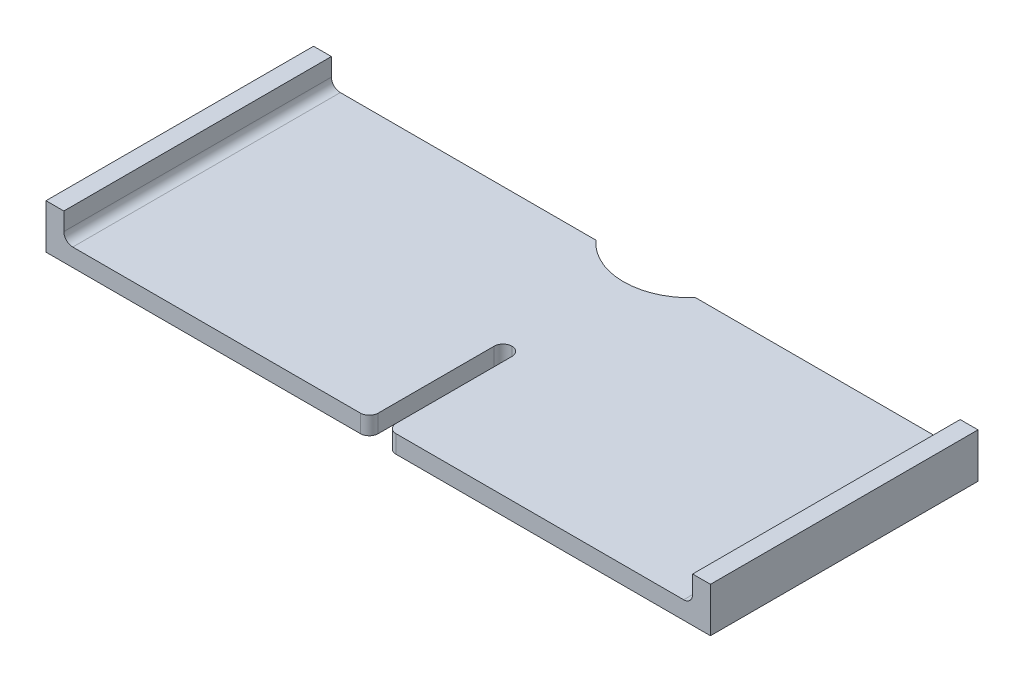
ISO-10303-21;
HEADER;
FILE_DESCRIPTION(('STEP AP214'),'2;1');
FILE_NAME('part.step','',(''),(''),'','','');
FILE_SCHEMA(('AUTOMOTIVE_DESIGN { 1 0 10303 214 1 1 1 1 }'));
ENDSEC;
DATA;
#1=APPLICATION_CONTEXT('core data for automotive mechanical design processes');
#2=APPLICATION_PROTOCOL_DEFINITION('international standard','automotive_design',2000,#1);
#3=PRODUCT_CONTEXT('',#1,'mechanical');
#4=PRODUCT('Part','Part','',(#3));
#5=PRODUCT_RELATED_PRODUCT_CATEGORY('part','',(#4));
#6=PRODUCT_DEFINITION_FORMATION('','',#4);
#7=PRODUCT_DEFINITION_CONTEXT('part definition',#1,'design');
#8=PRODUCT_DEFINITION('design','',#6,#7);
#9=PRODUCT_DEFINITION_SHAPE('','',#8);
#10=(LENGTH_UNIT() NAMED_UNIT(*) SI_UNIT(.MILLI.,.METRE.));
#11=(NAMED_UNIT(*) PLANE_ANGLE_UNIT() SI_UNIT($,.RADIAN.));
#12=(NAMED_UNIT(*) SI_UNIT($,.STERADIAN.) SOLID_ANGLE_UNIT());
#13=UNCERTAINTY_MEASURE_WITH_UNIT(LENGTH_MEASURE(1.E-05),#10,'distance_accuracy_value','');
#14=(GEOMETRIC_REPRESENTATION_CONTEXT(3) GLOBAL_UNCERTAINTY_ASSIGNED_CONTEXT((#13)) GLOBAL_UNIT_ASSIGNED_CONTEXT((#10,
#11,#12)) REPRESENTATION_CONTEXT('',''));
#15=CARTESIAN_POINT('',(0.,0.,0.));
#16=DIRECTION('',(0.,0.,1.));
#17=DIRECTION('',(1.,0.,0.));
#18=AXIS2_PLACEMENT_3D('',#15,#16,#17);
#19=CARTESIAN_POINT('',(37.25,2.,-15.));
#20=DIRECTION('',(0.,0.,1.));
#21=DIRECTION('',(1.,0.,0.));
#22=AXIS2_PLACEMENT_3D('',#19,#20,#21);
#23=PLANE('',#22);
#24=DIRECTION('',(-1.,0.,0.));
#25=VECTOR('',#24,1.);
#26=CARTESIAN_POINT('',(37.25,0.,-15.));
#27=LINE('',#26,#25);
#28=CARTESIAN_POINT('',(37.25,0.,-15.));
#29=VERTEX_POINT('',#28);
#30=CARTESIAN_POINT('',(5.59016994374948,0.,-15.));
#31=VERTEX_POINT('',#30);
#32=EDGE_CURVE('E196',#29,#31,#27,.T.);
#33=ORIENTED_EDGE('',*,*,#32,.T.);
#34=DIRECTION('',(0.,1.,0.));
#35=VECTOR('',#34,1.);
#36=CARTESIAN_POINT('',(5.59016994374948,0.,-15.));
#37=LINE('',#36,#35);
#38=CARTESIAN_POINT('',(5.59016994374948,2.,-15.));
#39=VERTEX_POINT('',#38);
#40=EDGE_CURVE('E175',#31,#39,#37,.T.);
#41=ORIENTED_EDGE('',*,*,#40,.T.);
#42=DIRECTION('',(-1.,0.,0.));
#43=VECTOR('',#42,1.);
#44=CARTESIAN_POINT('',(37.25,2.,-15.));
#45=LINE('',#44,#43);
#46=CARTESIAN_POINT('',(34.25,2.,-15.));
#47=VERTEX_POINT('',#46);
#48=EDGE_CURVE('E207',#47,#39,#45,.T.);
#49=ORIENTED_EDGE('',*,*,#48,.F.);
#50=CARTESIAN_POINT('',(34.25,3.,-15.));
#51=DIRECTION('',(0.,0.,1.));
#52=DIRECTION('',(1.,0.,0.));
#53=AXIS2_PLACEMENT_3D('',#50,#51,#52);
#54=CIRCLE('',#53,1.);
#55=CARTESIAN_POINT('',(35.25,3.,-15.));
#56=VERTEX_POINT('',#55);
#57=EDGE_CURVE('E46',#47,#56,#54,.T.);
#58=ORIENTED_EDGE('',*,*,#57,.T.);
#59=DIRECTION('',(0.,-1.,0.));
#60=VECTOR('',#59,1.);
#61=CARTESIAN_POINT('',(35.25,5.,-15.));
#62=LINE('',#61,#60);
#63=CARTESIAN_POINT('',(35.25,5.,-15.));
#64=VERTEX_POINT('',#63);
#65=EDGE_CURVE('E262',#64,#56,#62,.T.);
#66=ORIENTED_EDGE('',*,*,#65,.F.);
#67=DIRECTION('',(-1.,0.,0.));
#68=VECTOR('',#67,1.);
#69=CARTESIAN_POINT('',(37.25,5.,-15.));
#70=LINE('',#69,#68);
#71=CARTESIAN_POINT('',(37.25,5.,-15.));
#72=VERTEX_POINT('',#71);
#73=EDGE_CURVE('E301',#72,#64,#70,.T.);
#74=ORIENTED_EDGE('',*,*,#73,.F.);
#75=DIRECTION('',(0.,-1.,0.));
#76=VECTOR('',#75,1.);
#77=CARTESIAN_POINT('',(37.25,2.,-15.));
#78=LINE('',#77,#76);
#79=EDGE_CURVE('E206',#72,#29,#78,.T.);
#80=ORIENTED_EDGE('',*,*,#79,.T.);
#81=EDGE_LOOP('',(#33,#41,#49,#58,#66,#74,#80));
#82=FACE_BOUND('',#81,.T.);
#83=ADVANCED_FACE('F37',(#82),#23,.F.);
#84=CARTESIAN_POINT('',(37.25,2.,15.));
#85=DIRECTION('',(0.,0.,-1.));
#86=DIRECTION('',(-1.,0.,0.));
#87=AXIS2_PLACEMENT_3D('',#84,#85,#86);
#88=PLANE('',#87);
#89=DIRECTION('',(1.,0.,0.));
#90=VECTOR('',#89,1.);
#91=CARTESIAN_POINT('',(37.25,0.,15.));
#92=LINE('',#91,#90);
#93=CARTESIAN_POINT('',(-37.25,0.,15.));
#94=VERTEX_POINT('',#93);
#95=CARTESIAN_POINT('',(-2.,0.,15.));
#96=VERTEX_POINT('',#95);
#97=EDGE_CURVE('E200',#94,#96,#92,.T.);
#98=ORIENTED_EDGE('',*,*,#97,.T.);
#99=DIRECTION('',(0.,1.,0.));
#100=VECTOR('',#99,1.);
#101=CARTESIAN_POINT('',(-2.,2.,15.));
#102=LINE('',#101,#100);
#103=CARTESIAN_POINT('',(-2.,2.,15.));
#104=VERTEX_POINT('',#103);
#105=EDGE_CURVE('E235',#96,#104,#102,.T.);
#106=ORIENTED_EDGE('',*,*,#105,.T.);
#107=DIRECTION('',(1.,0.,0.));
#108=VECTOR('',#107,1.);
#109=CARTESIAN_POINT('',(37.25,2.,15.));
#110=LINE('',#109,#108);
#111=CARTESIAN_POINT('',(-34.25,2.,15.));
#112=VERTEX_POINT('',#111);
#113=EDGE_CURVE('E283',#112,#104,#110,.T.);
#114=ORIENTED_EDGE('',*,*,#113,.F.);
#115=CARTESIAN_POINT('',(-34.25,3.,15.));
#116=DIRECTION('',(0.,0.,-1.));
#117=DIRECTION('',(-1.,0.,0.));
#118=AXIS2_PLACEMENT_3D('',#115,#116,#117);
#119=CIRCLE('',#118,1.);
#120=CARTESIAN_POINT('',(-35.25,3.,15.));
#121=VERTEX_POINT('',#120);
#122=EDGE_CURVE('E253',#112,#121,#119,.T.);
#123=ORIENTED_EDGE('',*,*,#122,.T.);
#124=DIRECTION('',(0.,-1.,0.));
#125=VECTOR('',#124,1.);
#126=CARTESIAN_POINT('',(-35.25,5.,15.));
#127=LINE('',#126,#125);
#128=CARTESIAN_POINT('',(-35.25,5.,15.));
#129=VERTEX_POINT('',#128);
#130=EDGE_CURVE('E306',#129,#121,#127,.T.);
#131=ORIENTED_EDGE('',*,*,#130,.F.);
#132=DIRECTION('',(1.,0.,0.));
#133=VECTOR('',#132,1.);
#134=CARTESIAN_POINT('',(-37.25,5.,15.));
#135=LINE('',#134,#133);
#136=CARTESIAN_POINT('',(-37.25,5.,15.));
#137=VERTEX_POINT('',#136);
#138=EDGE_CURVE('E321',#137,#129,#135,.T.);
#139=ORIENTED_EDGE('',*,*,#138,.F.);
#140=DIRECTION('',(0.,-1.,0.));
#141=VECTOR('',#140,1.);
#142=CARTESIAN_POINT('',(-37.25,2.,15.));
#143=LINE('',#142,#141);
#144=EDGE_CURVE('E180',#137,#94,#143,.T.);
#145=ORIENTED_EDGE('',*,*,#144,.T.);
#146=EDGE_LOOP('',(#98,#106,#114,#123,#131,#139,#145));
#147=FACE_BOUND('',#146,.T.);
#148=ADVANCED_FACE('F345',(#147),#88,.F.);
#149=CARTESIAN_POINT('',(0.,2.,0.));
#150=DIRECTION('',(0.,1.,0.));
#151=DIRECTION('',(0.,0.,1.));
#152=AXIS2_PLACEMENT_3D('',#149,#150,#151);
#153=PLANE('',#152);
#154=DIRECTION('',(0.,0.,-1.));
#155=VECTOR('',#154,1.);
#156=CARTESIAN_POINT('',(1.,2.,0.));
#157=LINE('',#156,#155);
#158=CARTESIAN_POINT('',(1.,2.,14.));
#159=VERTEX_POINT('',#158);
#160=CARTESIAN_POINT('',(1.,2.,1.));
#161=VERTEX_POINT('',#160);
#162=EDGE_CURVE('E329',#159,#161,#157,.T.);
#163=ORIENTED_EDGE('',*,*,#162,.F.);
#164=CARTESIAN_POINT('',(2.,2.,14.));
#165=DIRECTION('',(0.,1.,0.));
#166=DIRECTION('',(0.,0.,1.));
#167=AXIS2_PLACEMENT_3D('',#164,#165,#166);
#168=CIRCLE('',#167,1.);
#169=CARTESIAN_POINT('',(2.,2.,15.));
#170=VERTEX_POINT('',#169);
#171=EDGE_CURVE('E227',#159,#170,#168,.T.);
#172=ORIENTED_EDGE('',*,*,#171,.T.);
#173=CARTESIAN_POINT('',(34.25,2.,15.));
#174=VERTEX_POINT('',#173);
#175=EDGE_CURVE('E199',#170,#174,#110,.T.);
#176=ORIENTED_EDGE('',*,*,#175,.T.);
#177=DIRECTION('',(0.,0.,-1.));
#178=VECTOR('',#177,1.);
#179=CARTESIAN_POINT('',(34.25,2.,0.));
#180=LINE('',#179,#178);
#181=EDGE_CURVE('E219',#174,#47,#180,.T.);
#182=ORIENTED_EDGE('',*,*,#181,.T.);
#183=ORIENTED_EDGE('',*,*,#48,.T.);
#184=CARTESIAN_POINT('',(0.,2.,-20.));
#185=DIRECTION('',(0.,1.,0.));
#186=DIRECTION('',(0.,0.,1.));
#187=AXIS2_PLACEMENT_3D('',#184,#185,#186);
#188=CIRCLE('',#187,7.5);
#189=CARTESIAN_POINT('',(-5.59016994374947,2.,-15.));
#190=VERTEX_POINT('',#189);
#191=EDGE_CURVE('E189',#190,#39,#188,.T.);
#192=ORIENTED_EDGE('',*,*,#191,.F.);
#193=CARTESIAN_POINT('',(-34.25,2.,-15.));
#194=VERTEX_POINT('',#193);
#195=EDGE_CURVE('E188',#190,#194,#45,.T.);
#196=ORIENTED_EDGE('',*,*,#195,.T.);
#197=DIRECTION('',(0.,0.,1.));
#198=VECTOR('',#197,1.);
#199=CARTESIAN_POINT('',(-34.25,2.,0.));
#200=LINE('',#199,#198);
#201=EDGE_CURVE('E222',#194,#112,#200,.T.);
#202=ORIENTED_EDGE('',*,*,#201,.T.);
#203=ORIENTED_EDGE('',*,*,#113,.T.);
#204=CARTESIAN_POINT('',(-2.,2.,14.));
#205=DIRECTION('',(0.,1.,0.));
#206=DIRECTION('',(0.,0.,1.));
#207=AXIS2_PLACEMENT_3D('',#204,#205,#206);
#208=CIRCLE('',#207,1.);
#209=CARTESIAN_POINT('',(-1.,2.,14.));
#210=VERTEX_POINT('',#209);
#211=EDGE_CURVE('E225',#104,#210,#208,.T.);
#212=ORIENTED_EDGE('',*,*,#211,.T.);
#213=DIRECTION('',(0.,0.,1.));
#214=VECTOR('',#213,1.);
#215=CARTESIAN_POINT('',(-1.,2.,0.));
#216=LINE('',#215,#214);
#217=CARTESIAN_POINT('',(-1.,2.,1.));
#218=VERTEX_POINT('',#217);
#219=EDGE_CURVE('E326',#218,#210,#216,.T.);
#220=ORIENTED_EDGE('',*,*,#219,.F.);
#221=CARTESIAN_POINT('',(0.,2.,1.));
#222=DIRECTION('',(0.,1.,0.));
#223=DIRECTION('',(0.,0.,1.));
#224=AXIS2_PLACEMENT_3D('',#221,#222,#223);
#225=CIRCLE('',#224,1.);
#226=CARTESIAN_POINT('',(0.,2.,0.));
#227=VERTEX_POINT('',#226);
#228=EDGE_CURVE('E61',#218,#227,#225,.F.);
#229=ORIENTED_EDGE('',*,*,#228,.T.);
#230=CARTESIAN_POINT('',(0.,2.,1.));
#231=DIRECTION('',(0.,1.,0.));
#232=DIRECTION('',(0.,0.,1.));
#233=AXIS2_PLACEMENT_3D('',#230,#231,#232);
#234=CIRCLE('',#233,1.);
#235=EDGE_CURVE('E250',#227,#161,#234,.F.);
#236=ORIENTED_EDGE('',*,*,#235,.T.);
#237=EDGE_LOOP('',(#163,#172,#176,#182,#183,#192,#196,#202,#203,#212,#220,#229,#236));
#238=FACE_BOUND('',#237,.T.);
#239=ADVANCED_FACE('F282',(#238),#153,.T.);
#240=CARTESIAN_POINT('',(-37.25,2.,15.));
#241=DIRECTION('',(1.,0.,0.));
#242=DIRECTION('',(0.,0.,-1.));
#243=AXIS2_PLACEMENT_3D('',#240,#241,#242);
#244=PLANE('',#243);
#245=DIRECTION('',(0.,0.,1.));
#246=VECTOR('',#245,1.);
#247=CARTESIAN_POINT('',(-37.25,0.,15.));
#248=LINE('',#247,#246);
#249=CARTESIAN_POINT('',(-37.25,0.,-15.));
#250=VERTEX_POINT('',#249);
#251=EDGE_CURVE('E195',#250,#94,#248,.T.);
#252=ORIENTED_EDGE('',*,*,#251,.T.);
#253=ORIENTED_EDGE('',*,*,#144,.F.);
#254=DIRECTION('',(0.,0.,1.));
#255=VECTOR('',#254,1.);
#256=CARTESIAN_POINT('',(-37.25,5.,15.));
#257=LINE('',#256,#255);
#258=CARTESIAN_POINT('',(-37.25,5.,-15.));
#259=VERTEX_POINT('',#258);
#260=EDGE_CURVE('E323',#259,#137,#257,.T.);
#261=ORIENTED_EDGE('',*,*,#260,.F.);
#262=DIRECTION('',(0.,-1.,0.));
#263=VECTOR('',#262,1.);
#264=CARTESIAN_POINT('',(-37.25,2.,-15.));
#265=LINE('',#264,#263);
#266=EDGE_CURVE('E204',#259,#250,#265,.T.);
#267=ORIENTED_EDGE('',*,*,#266,.T.);
#268=EDGE_LOOP('',(#252,#253,#261,#267));
#269=FACE_BOUND('',#268,.T.);
#270=ADVANCED_FACE('F356',(#269),#244,.F.);
#271=ORIENTED_EDGE('',*,*,#175,.F.);
#272=DIRECTION('',(0.,1.,0.));
#273=VECTOR('',#272,1.);
#274=CARTESIAN_POINT('',(2.,2.,15.));
#275=LINE('',#274,#273);
#276=CARTESIAN_POINT('',(2.,0.,15.));
#277=VERTEX_POINT('',#276);
#278=EDGE_CURVE('E229',#170,#277,#275,.F.);
#279=ORIENTED_EDGE('',*,*,#278,.T.);
#280=CARTESIAN_POINT('',(37.25,0.,15.));
#281=VERTEX_POINT('',#280);
#282=EDGE_CURVE('E289',#277,#281,#92,.T.);
#283=ORIENTED_EDGE('',*,*,#282,.T.);
#284=DIRECTION('',(0.,-1.,0.));
#285=VECTOR('',#284,1.);
#286=CARTESIAN_POINT('',(37.25,2.,15.));
#287=LINE('',#286,#285);
#288=CARTESIAN_POINT('',(37.25,5.,15.));
#289=VERTEX_POINT('',#288);
#290=EDGE_CURVE('E210',#289,#281,#287,.T.);
#291=ORIENTED_EDGE('',*,*,#290,.F.);
#292=DIRECTION('',(1.,0.,0.));
#293=VECTOR('',#292,1.);
#294=CARTESIAN_POINT('',(37.25,5.,15.));
#295=LINE('',#294,#293);
#296=CARTESIAN_POINT('',(35.25,5.,15.));
#297=VERTEX_POINT('',#296);
#298=EDGE_CURVE('E305',#297,#289,#295,.T.);
#299=ORIENTED_EDGE('',*,*,#298,.F.);
#300=DIRECTION('',(0.,-1.,0.));
#301=VECTOR('',#300,1.);
#302=CARTESIAN_POINT('',(35.25,5.,15.));
#303=LINE('',#302,#301);
#304=CARTESIAN_POINT('',(35.25,3.,15.));
#305=VERTEX_POINT('',#304);
#306=EDGE_CURVE('E272',#297,#305,#303,.T.);
#307=ORIENTED_EDGE('',*,*,#306,.T.);
#308=CARTESIAN_POINT('',(34.25,3.,15.));
#309=DIRECTION('',(0.,0.,-1.));
#310=DIRECTION('',(-1.,0.,0.));
#311=AXIS2_PLACEMENT_3D('',#308,#309,#310);
#312=CIRCLE('',#311,1.);
#313=EDGE_CURVE('E11',#305,#174,#312,.T.);
#314=ORIENTED_EDGE('',*,*,#313,.T.);
#315=EDGE_LOOP('',(#271,#279,#283,#291,#299,#307,#314));
#316=FACE_BOUND('',#315,.T.);
#317=ADVANCED_FACE('F278',(#316),#88,.F.);
#318=CARTESIAN_POINT('',(37.25,2.,15.));
#319=DIRECTION('',(-1.,0.,0.));
#320=DIRECTION('',(0.,0.,1.));
#321=AXIS2_PLACEMENT_3D('',#318,#319,#320);
#322=PLANE('',#321);
#323=DIRECTION('',(0.,0.,-1.));
#324=VECTOR('',#323,1.);
#325=CARTESIAN_POINT('',(37.25,0.,15.));
#326=LINE('',#325,#324);
#327=EDGE_CURVE('E197',#281,#29,#326,.T.);
#328=ORIENTED_EDGE('',*,*,#327,.T.);
#329=ORIENTED_EDGE('',*,*,#79,.F.);
#330=DIRECTION('',(0.,0.,-1.));
#331=VECTOR('',#330,1.);
#332=CARTESIAN_POINT('',(37.25,5.,15.));
#333=LINE('',#332,#331);
#334=EDGE_CURVE('E300',#289,#72,#333,.T.);
#335=ORIENTED_EDGE('',*,*,#334,.F.);
#336=ORIENTED_EDGE('',*,*,#290,.T.);
#337=EDGE_LOOP('',(#328,#329,#335,#336));
#338=FACE_BOUND('',#337,.T.);
#339=ADVANCED_FACE('F298',(#338),#322,.F.);
#340=ORIENTED_EDGE('',*,*,#195,.F.);
#341=DIRECTION('',(0.,1.,0.));
#342=VECTOR('',#341,1.);
#343=CARTESIAN_POINT('',(-5.59016994374947,0.,-15.));
#344=LINE('',#343,#342);
#345=CARTESIAN_POINT('',(-5.59016994374947,0.,-15.));
#346=VERTEX_POINT('',#345);
#347=EDGE_CURVE('E172',#190,#346,#344,.F.);
#348=ORIENTED_EDGE('',*,*,#347,.T.);
#349=EDGE_CURVE('E185',#346,#250,#27,.T.);
#350=ORIENTED_EDGE('',*,*,#349,.T.);
#351=ORIENTED_EDGE('',*,*,#266,.F.);
#352=DIRECTION('',(-1.,0.,0.));
#353=VECTOR('',#352,1.);
#354=CARTESIAN_POINT('',(-37.25,5.,-15.));
#355=LINE('',#354,#353);
#356=CARTESIAN_POINT('',(-35.25,5.,-15.));
#357=VERTEX_POINT('',#356);
#358=EDGE_CURVE('E316',#357,#259,#355,.T.);
#359=ORIENTED_EDGE('',*,*,#358,.F.);
#360=DIRECTION('',(0.,-1.,0.));
#361=VECTOR('',#360,1.);
#362=CARTESIAN_POINT('',(-35.25,5.,-15.));
#363=LINE('',#362,#361);
#364=CARTESIAN_POINT('',(-35.25,3.,-15.));
#365=VERTEX_POINT('',#364);
#366=EDGE_CURVE('E309',#357,#365,#363,.T.);
#367=ORIENTED_EDGE('',*,*,#366,.T.);
#368=CARTESIAN_POINT('',(-34.25,3.,-15.));
#369=DIRECTION('',(0.,0.,1.));
#370=DIRECTION('',(1.,0.,0.));
#371=AXIS2_PLACEMENT_3D('',#368,#369,#370);
#372=CIRCLE('',#371,1.);
#373=EDGE_CURVE('E255',#365,#194,#372,.T.);
#374=ORIENTED_EDGE('',*,*,#373,.T.);
#375=EDGE_LOOP('',(#340,#348,#350,#351,#359,#367,#374));
#376=FACE_BOUND('',#375,.T.);
#377=ADVANCED_FACE('F184',(#376),#23,.F.);
#378=CARTESIAN_POINT('',(0.,0.,0.));
#379=DIRECTION('',(0.,1.,0.));
#380=DIRECTION('',(0.,0.,1.));
#381=AXIS2_PLACEMENT_3D('',#378,#379,#380);
#382=PLANE('',#381);
#383=ORIENTED_EDGE('',*,*,#282,.F.);
#384=CARTESIAN_POINT('',(2.,0.,14.));
#385=DIRECTION('',(0.,1.,0.));
#386=DIRECTION('',(0.,0.,1.));
#387=AXIS2_PLACEMENT_3D('',#384,#385,#386);
#388=CIRCLE('',#387,1.);
#389=CARTESIAN_POINT('',(1.,0.,14.));
#390=VERTEX_POINT('',#389);
#391=EDGE_CURVE('E233',#277,#390,#388,.F.);
#392=ORIENTED_EDGE('',*,*,#391,.T.);
#393=DIRECTION('',(0.,0.,-1.));
#394=VECTOR('',#393,1.);
#395=CARTESIAN_POINT('',(1.,0.,15.));
#396=LINE('',#395,#394);
#397=CARTESIAN_POINT('',(1.,0.,1.));
#398=VERTEX_POINT('',#397);
#399=EDGE_CURVE('E335',#390,#398,#396,.T.);
#400=ORIENTED_EDGE('',*,*,#399,.T.);
#401=CARTESIAN_POINT('',(0.,0.,1.));
#402=DIRECTION('',(0.,1.,0.));
#403=DIRECTION('',(0.,0.,1.));
#404=AXIS2_PLACEMENT_3D('',#401,#402,#403);
#405=CIRCLE('',#404,1.);
#406=CARTESIAN_POINT('',(0.,0.,0.));
#407=VERTEX_POINT('',#406);
#408=EDGE_CURVE('E53',#398,#407,#405,.T.);
#409=ORIENTED_EDGE('',*,*,#408,.T.);
#410=CARTESIAN_POINT('',(0.,0.,1.));
#411=DIRECTION('',(0.,1.,0.));
#412=DIRECTION('',(0.,0.,1.));
#413=AXIS2_PLACEMENT_3D('',#410,#411,#412);
#414=CIRCLE('',#413,1.);
#415=CARTESIAN_POINT('',(-1.,0.,1.));
#416=VERTEX_POINT('',#415);
#417=EDGE_CURVE('E248',#407,#416,#414,.T.);
#418=ORIENTED_EDGE('',*,*,#417,.T.);
#419=DIRECTION('',(0.,0.,1.));
#420=VECTOR('',#419,1.);
#421=CARTESIAN_POINT('',(-1.,0.,0.));
#422=LINE('',#421,#420);
#423=CARTESIAN_POINT('',(-1.,0.,14.));
#424=VERTEX_POINT('',#423);
#425=EDGE_CURVE('E332',#416,#424,#422,.T.);
#426=ORIENTED_EDGE('',*,*,#425,.T.);
#427=CARTESIAN_POINT('',(-2.,0.,14.));
#428=DIRECTION('',(0.,1.,0.));
#429=DIRECTION('',(0.,0.,1.));
#430=AXIS2_PLACEMENT_3D('',#427,#428,#429);
#431=CIRCLE('',#430,1.);
#432=EDGE_CURVE('E231',#424,#96,#431,.F.);
#433=ORIENTED_EDGE('',*,*,#432,.T.);
#434=ORIENTED_EDGE('',*,*,#97,.F.);
#435=ORIENTED_EDGE('',*,*,#251,.F.);
#436=ORIENTED_EDGE('',*,*,#349,.F.);
#437=CARTESIAN_POINT('',(0.,0.,-20.));
#438=DIRECTION('',(0.,1.,0.));
#439=DIRECTION('',(0.,0.,1.));
#440=AXIS2_PLACEMENT_3D('',#437,#438,#439);
#441=CIRCLE('',#440,7.5);
#442=EDGE_CURVE('E168',#346,#31,#441,.T.);
#443=ORIENTED_EDGE('',*,*,#442,.T.);
#444=ORIENTED_EDGE('',*,*,#32,.F.);
#445=ORIENTED_EDGE('',*,*,#327,.F.);
#446=EDGE_LOOP('',(#383,#392,#400,#409,#418,#426,#433,#434,#435,#436,#443,#444,#445));
#447=FACE_BOUND('',#446,.T.);
#448=ADVANCED_FACE('F193',(#447),#382,.F.);
#449=CARTESIAN_POINT('',(35.25,5.,15.));
#450=DIRECTION('',(1.,0.,0.));
#451=DIRECTION('',(0.,0.,-1.));
#452=AXIS2_PLACEMENT_3D('',#449,#450,#451);
#453=PLANE('',#452);
#454=ORIENTED_EDGE('',*,*,#65,.T.);
#455=DIRECTION('',(0.,0.,-1.));
#456=VECTOR('',#455,1.);
#457=CARTESIAN_POINT('',(35.25,3.,15.));
#458=LINE('',#457,#456);
#459=EDGE_CURVE('E245',#56,#305,#458,.F.);
#460=ORIENTED_EDGE('',*,*,#459,.T.);
#461=ORIENTED_EDGE('',*,*,#306,.F.);
#462=DIRECTION('',(0.,0.,1.));
#463=VECTOR('',#462,1.);
#464=CARTESIAN_POINT('',(35.25,5.,15.));
#465=LINE('',#464,#463);
#466=EDGE_CURVE('E271',#64,#297,#465,.T.);
#467=ORIENTED_EDGE('',*,*,#466,.F.);
#468=EDGE_LOOP('',(#454,#460,#461,#467));
#469=FACE_BOUND('',#468,.T.);
#470=ADVANCED_FACE('F268',(#469),#453,.F.);
#471=CARTESIAN_POINT('',(0.,5.,0.));
#472=DIRECTION('',(0.,1.,0.));
#473=DIRECTION('',(0.,0.,1.));
#474=AXIS2_PLACEMENT_3D('',#471,#472,#473);
#475=PLANE('',#474);
#476=ORIENTED_EDGE('',*,*,#334,.T.);
#477=ORIENTED_EDGE('',*,*,#73,.T.);
#478=ORIENTED_EDGE('',*,*,#466,.T.);
#479=ORIENTED_EDGE('',*,*,#298,.T.);
#480=EDGE_LOOP('',(#476,#477,#478,#479));
#481=FACE_BOUND('',#480,.T.);
#482=ADVANCED_FACE('F304',(#481),#475,.T.);
#483=CARTESIAN_POINT('',(-35.25,5.,15.));
#484=DIRECTION('',(-1.,0.,0.));
#485=DIRECTION('',(0.,0.,1.));
#486=AXIS2_PLACEMENT_3D('',#483,#484,#485);
#487=PLANE('',#486);
#488=ORIENTED_EDGE('',*,*,#130,.T.);
#489=DIRECTION('',(0.,0.,1.));
#490=VECTOR('',#489,1.);
#491=CARTESIAN_POINT('',(-35.25,3.,15.));
#492=LINE('',#491,#490);
#493=EDGE_CURVE('E243',#121,#365,#492,.F.);
#494=ORIENTED_EDGE('',*,*,#493,.T.);
#495=ORIENTED_EDGE('',*,*,#366,.F.);
#496=DIRECTION('',(0.,0.,-1.));
#497=VECTOR('',#496,1.);
#498=CARTESIAN_POINT('',(-35.25,5.,15.));
#499=LINE('',#498,#497);
#500=EDGE_CURVE('E319',#129,#357,#499,.T.);
#501=ORIENTED_EDGE('',*,*,#500,.F.);
#502=EDGE_LOOP('',(#488,#494,#495,#501));
#503=FACE_BOUND('',#502,.T.);
#504=ADVANCED_FACE('F349',(#503),#487,.F.);
#505=CARTESIAN_POINT('',(0.,5.,0.));
#506=DIRECTION('',(0.,-1.,0.));
#507=DIRECTION('',(0.,0.,-1.));
#508=AXIS2_PLACEMENT_3D('',#505,#506,#507);
#509=PLANE('',#508);
#510=ORIENTED_EDGE('',*,*,#260,.T.);
#511=ORIENTED_EDGE('',*,*,#138,.T.);
#512=ORIENTED_EDGE('',*,*,#500,.T.);
#513=ORIENTED_EDGE('',*,*,#358,.T.);
#514=EDGE_LOOP('',(#510,#511,#512,#513));
#515=FACE_BOUND('',#514,.T.);
#516=ADVANCED_FACE('F353',(#515),#509,.F.);
#517=CARTESIAN_POINT('',(-1.,0.,0.));
#518=DIRECTION('',(-1.,0.,0.));
#519=DIRECTION('',(0.,0.,1.));
#520=AXIS2_PLACEMENT_3D('',#517,#518,#519);
#521=PLANE('',#520);
#522=ORIENTED_EDGE('',*,*,#219,.T.);
#523=DIRECTION('',(0.,1.,0.));
#524=VECTOR('',#523,1.);
#525=CARTESIAN_POINT('',(-1.,0.,14.));
#526=LINE('',#525,#524);
#527=EDGE_CURVE('E241',#210,#424,#526,.F.);
#528=ORIENTED_EDGE('',*,*,#527,.T.);
#529=ORIENTED_EDGE('',*,*,#425,.F.);
#530=DIRECTION('',(0.,1.,0.));
#531=VECTOR('',#530,1.);
#532=CARTESIAN_POINT('',(-1.,2.,1.));
#533=LINE('',#532,#531);
#534=EDGE_CURVE('E238',#416,#218,#533,.T.);
#535=ORIENTED_EDGE('',*,*,#534,.T.);
#536=EDGE_LOOP('',(#522,#528,#529,#535));
#537=FACE_BOUND('',#536,.T.);
#538=ADVANCED_FACE('F427',(#537),#521,.F.);
#539=CARTESIAN_POINT('',(1.,0.,15.));
#540=DIRECTION('',(1.,0.,0.));
#541=DIRECTION('',(0.,0.,-1.));
#542=AXIS2_PLACEMENT_3D('',#539,#540,#541);
#543=PLANE('',#542);
#544=ORIENTED_EDGE('',*,*,#399,.F.);
#545=DIRECTION('',(0.,1.,0.));
#546=VECTOR('',#545,1.);
#547=CARTESIAN_POINT('',(1.,0.,14.));
#548=LINE('',#547,#546);
#549=EDGE_CURVE('E216',#390,#159,#548,.T.);
#550=ORIENTED_EDGE('',*,*,#549,.T.);
#551=ORIENTED_EDGE('',*,*,#162,.T.);
#552=DIRECTION('',(0.,1.,0.));
#553=VECTOR('',#552,1.);
#554=CARTESIAN_POINT('',(1.,0.,1.));
#555=LINE('',#554,#553);
#556=EDGE_CURVE('E179',#161,#398,#555,.F.);
#557=ORIENTED_EDGE('',*,*,#556,.T.);
#558=EDGE_LOOP('',(#544,#550,#551,#557));
#559=FACE_BOUND('',#558,.T.);
#560=ADVANCED_FACE('F432',(#559),#543,.F.);
#561=CARTESIAN_POINT('',(0.,0.,-20.));
#562=DIRECTION('',(0.,1.,0.));
#563=DIRECTION('',(0.,0.,1.));
#564=AXIS2_PLACEMENT_3D('',#561,#562,#563);
#565=CYLINDRICAL_SURFACE('',#564,7.5);
#566=ORIENTED_EDGE('',*,*,#442,.F.);
#567=ORIENTED_EDGE('',*,*,#347,.F.);
#568=ORIENTED_EDGE('',*,*,#191,.T.);
#569=ORIENTED_EDGE('',*,*,#40,.F.);
#570=EDGE_LOOP('',(#566,#567,#568,#569));
#571=FACE_BOUND('',#570,.T.);
#572=ADVANCED_FACE('F170',(#571),#565,.F.);
#573=CARTESIAN_POINT('',(2.,0.,14.));
#574=DIRECTION('',(0.,1.,0.));
#575=DIRECTION('',(0.,0.,1.));
#576=AXIS2_PLACEMENT_3D('',#573,#574,#575);
#577=CYLINDRICAL_SURFACE('',#576,1.);
#578=ORIENTED_EDGE('',*,*,#391,.F.);
#579=ORIENTED_EDGE('',*,*,#278,.F.);
#580=ORIENTED_EDGE('',*,*,#171,.F.);
#581=ORIENTED_EDGE('',*,*,#549,.F.);
#582=EDGE_LOOP('',(#578,#579,#580,#581));
#583=FACE_BOUND('',#582,.T.);
#584=ADVANCED_FACE('F450',(#583),#577,.T.);
#585=CARTESIAN_POINT('',(-2.,2.,14.));
#586=DIRECTION('',(0.,1.,0.));
#587=DIRECTION('',(0.,0.,1.));
#588=AXIS2_PLACEMENT_3D('',#585,#586,#587);
#589=CYLINDRICAL_SURFACE('',#588,1.);
#590=ORIENTED_EDGE('',*,*,#432,.F.);
#591=ORIENTED_EDGE('',*,*,#527,.F.);
#592=ORIENTED_EDGE('',*,*,#211,.F.);
#593=ORIENTED_EDGE('',*,*,#105,.F.);
#594=EDGE_LOOP('',(#590,#591,#592,#593));
#595=FACE_BOUND('',#594,.T.);
#596=ADVANCED_FACE('F455',(#595),#589,.T.);
#597=CARTESIAN_POINT('',(0.,0.,1.));
#598=DIRECTION('',(0.,-1.,0.));
#599=DIRECTION('',(0.,0.,-1.));
#600=AXIS2_PLACEMENT_3D('',#597,#598,#599);
#601=CYLINDRICAL_SURFACE('',#600,1.);
#602=DIRECTION('',(0.,1.,0.));
#603=VECTOR('',#602,1.);
#604=CARTESIAN_POINT('',(0.,2.,0.));
#605=LINE('',#604,#603);
#606=EDGE_CURVE('E41',#407,#227,#605,.T.);
#607=ORIENTED_EDGE('',*,*,#606,.F.);
#608=ORIENTED_EDGE('',*,*,#408,.F.);
#609=ORIENTED_EDGE('',*,*,#556,.F.);
#610=ORIENTED_EDGE('',*,*,#235,.F.);
#611=EDGE_LOOP('',(#607,#608,#609,#610));
#612=FACE_BOUND('',#611,.T.);
#613=ADVANCED_FACE('F465',(#612),#601,.F.);
#614=CARTESIAN_POINT('',(0.,0.,1.));
#615=DIRECTION('',(0.,-1.,0.));
#616=DIRECTION('',(0.,0.,-1.));
#617=AXIS2_PLACEMENT_3D('',#614,#615,#616);
#618=CYLINDRICAL_SURFACE('',#617,1.);
#619=ORIENTED_EDGE('',*,*,#417,.F.);
#620=ORIENTED_EDGE('',*,*,#606,.T.);
#621=ORIENTED_EDGE('',*,*,#228,.F.);
#622=ORIENTED_EDGE('',*,*,#534,.F.);
#623=EDGE_LOOP('',(#619,#620,#621,#622));
#624=FACE_BOUND('',#623,.T.);
#625=ADVANCED_FACE('F475',(#624),#618,.F.);
#626=CARTESIAN_POINT('',(-34.25,3.,0.));
#627=DIRECTION('',(0.,0.,1.));
#628=DIRECTION('',(1.,0.,0.));
#629=AXIS2_PLACEMENT_3D('',#626,#627,#628);
#630=CYLINDRICAL_SURFACE('',#629,1.);
#631=ORIENTED_EDGE('',*,*,#373,.F.);
#632=ORIENTED_EDGE('',*,*,#493,.F.);
#633=ORIENTED_EDGE('',*,*,#122,.F.);
#634=ORIENTED_EDGE('',*,*,#201,.F.);
#635=EDGE_LOOP('',(#631,#632,#633,#634));
#636=FACE_BOUND('',#635,.T.);
#637=ADVANCED_FACE('F342',(#636),#630,.F.);
#638=CARTESIAN_POINT('',(34.25,3.,0.));
#639=DIRECTION('',(0.,0.,-1.));
#640=DIRECTION('',(-1.,0.,0.));
#641=AXIS2_PLACEMENT_3D('',#638,#639,#640);
#642=CYLINDRICAL_SURFACE('',#641,1.);
#643=ORIENTED_EDGE('',*,*,#313,.F.);
#644=ORIENTED_EDGE('',*,*,#459,.F.);
#645=ORIENTED_EDGE('',*,*,#57,.F.);
#646=ORIENTED_EDGE('',*,*,#181,.F.);
#647=EDGE_LOOP('',(#643,#644,#645,#646));
#648=FACE_BOUND('',#647,.T.);
#649=ADVANCED_FACE('F39',(#648),#642,.F.);
#650=CLOSED_SHELL('',(#83,#148,#239,#270,#317,#339,#377,#448,#470,#482,#504,#516,#538,#560,#572,
#584,#596,#613,#625,#637,#649));
#651=MANIFOLD_SOLID_BREP('B2',#650);
#652=ADVANCED_BREP_SHAPE_REPRESENTATION('',(#18,#651),#14);
#653=SHAPE_DEFINITION_REPRESENTATION(#9,#652);
ENDSEC;
END-ISO-10303-21;
